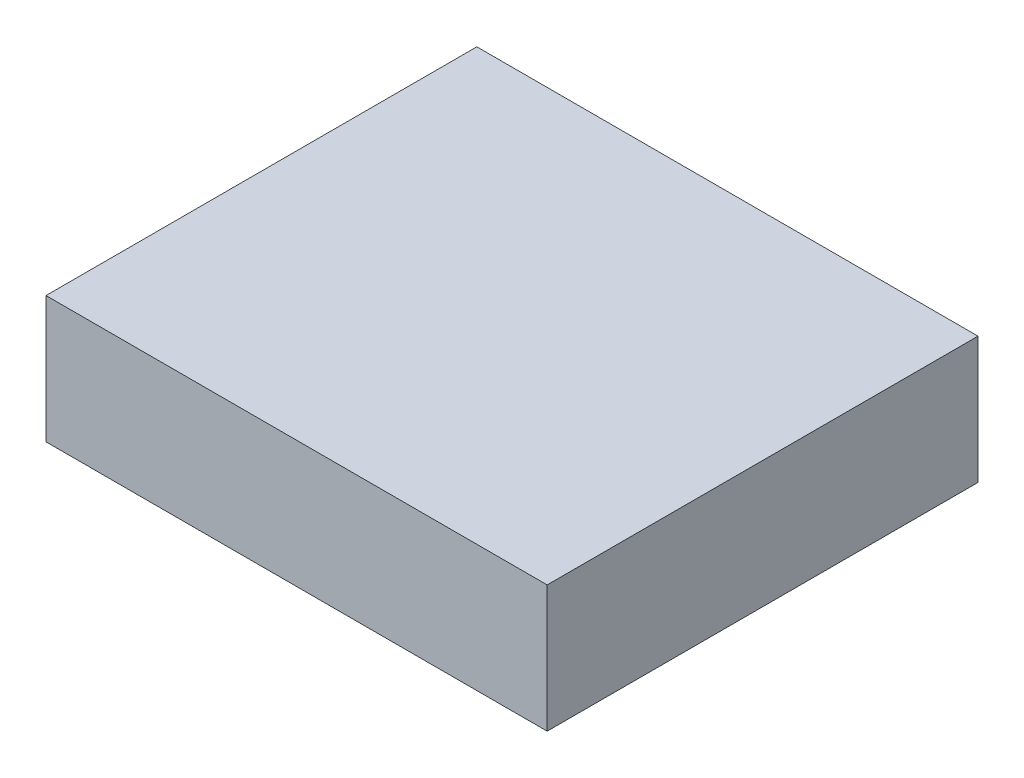
ISO-10303-21;
HEADER;
FILE_DESCRIPTION(('STEP AP214'),'2;1');
FILE_NAME('part.step','',(''),(''),'','','');
FILE_SCHEMA(('AUTOMOTIVE_DESIGN { 1 0 10303 214 1 1 1 1 }'));
ENDSEC;
DATA;
#1=APPLICATION_CONTEXT('core data for automotive mechanical design processes');
#2=APPLICATION_PROTOCOL_DEFINITION('international standard','automotive_design',2000,#1);
#3=PRODUCT_CONTEXT('',#1,'mechanical');
#4=PRODUCT('Part','Part','',(#3));
#5=PRODUCT_RELATED_PRODUCT_CATEGORY('part','',(#4));
#6=PRODUCT_DEFINITION_FORMATION('','',#4);
#7=PRODUCT_DEFINITION_CONTEXT('part definition',#1,'design');
#8=PRODUCT_DEFINITION('design','',#6,#7);
#9=PRODUCT_DEFINITION_SHAPE('','',#8);
#10=(LENGTH_UNIT() NAMED_UNIT(*) SI_UNIT(.MILLI.,.METRE.));
#11=(NAMED_UNIT(*) PLANE_ANGLE_UNIT() SI_UNIT($,.RADIAN.));
#12=(NAMED_UNIT(*) SI_UNIT($,.STERADIAN.) SOLID_ANGLE_UNIT());
#13=UNCERTAINTY_MEASURE_WITH_UNIT(LENGTH_MEASURE(1.E-05),#10,'distance_accuracy_value','');
#14=(GEOMETRIC_REPRESENTATION_CONTEXT(3) GLOBAL_UNCERTAINTY_ASSIGNED_CONTEXT((#13)) GLOBAL_UNIT_ASSIGNED_CONTEXT((#10,
#11,#12)) REPRESENTATION_CONTEXT('',''));
#15=CARTESIAN_POINT('',(0.,0.,0.));
#16=DIRECTION('',(0.,0.,1.));
#17=DIRECTION('',(1.,0.,0.));
#18=AXIS2_PLACEMENT_3D('',#15,#16,#17);
#19=CARTESIAN_POINT('',(0.,3.,0.));
#20=DIRECTION('',(0.,-1.,0.));
#21=DIRECTION('',(0.,0.,-1.));
#22=AXIS2_PLACEMENT_3D('',#19,#20,#21);
#23=PLANE('',#22);
#24=CARTESIAN_POINT('',(15.,3.,24.));
#25=DIRECTION('',(0.,1.,0.));
#26=DIRECTION('',(0.,0.,1.));
#27=AXIS2_PLACEMENT_3D('',#24,#25,#26);
#28=CIRCLE('',#27,10.5);
#29=CARTESIAN_POINT('',(15.,3.,34.5));
#30=VERTEX_POINT('',#29);
#31=EDGE_CURVE('E142',#30,#30,#28,.T.);
#32=ORIENTED_EDGE('',*,*,#31,.T.);
#33=EDGE_LOOP('',(#32));
#34=FACE_BOUND('',#33,.T.);
#35=DIRECTION('',(0.,0.,-1.));
#36=VECTOR('',#35,1.);
#37=CARTESIAN_POINT('',(-9.84277666215087,3.,40.));
#38=LINE('',#37,#36);
#39=CARTESIAN_POINT('',(-9.84277666215087,3.,39.8427766621509));
#40=VERTEX_POINT('',#39);
#41=CARTESIAN_POINT('',(-9.84277666215087,3.,48.8612539029861));
#42=VERTEX_POINT('',#41);
#43=EDGE_CURVE('E113',#40,#42,#38,.F.);
#44=ORIENTED_EDGE('',*,*,#43,.F.);
#45=DIRECTION('',(-1.,0.,0.));
#46=VECTOR('',#45,1.);
#47=CARTESIAN_POINT('',(-30.,3.,39.8427766621509));
#48=LINE('',#47,#46);
#49=CARTESIAN_POINT('',(-29.9475463643187,3.,39.8427766621509));
#50=VERTEX_POINT('',#49);
#51=EDGE_CURVE('E106',#50,#40,#48,.F.);
#52=ORIENTED_EDGE('',*,*,#51,.F.);
#53=CARTESIAN_POINT('',(0.,3.,0.));
#54=DIRECTION('',(0.,1.,0.));
#55=DIRECTION('',(0.,0.,1.));
#56=AXIS2_PLACEMENT_3D('',#53,#54,#55);
#57=CIRCLE('',#56,49.8427766621509);
#58=CARTESIAN_POINT('',(-42.8427766621509,3.,25.4715306424666));
#59=VERTEX_POINT('',#58);
#60=EDGE_CURVE('E110',#59,#50,#57,.T.);
#61=ORIENTED_EDGE('',*,*,#60,.F.);
#62=DIRECTION('',(0.,0.,-1.));
#63=VECTOR('',#62,1.);
#64=CARTESIAN_POINT('',(-42.8427766621509,3.,-25.5147016443462));
#65=LINE('',#64,#63);
#66=CARTESIAN_POINT('',(-42.8427766621509,3.,-25.4715306424666));
#67=VERTEX_POINT('',#66);
#68=EDGE_CURVE('E126',#67,#59,#65,.F.);
#69=ORIENTED_EDGE('',*,*,#68,.F.);
#70=CARTESIAN_POINT('',(0.,3.,0.));
#71=DIRECTION('',(0.,1.,0.));
#72=DIRECTION('',(0.,0.,1.));
#73=AXIS2_PLACEMENT_3D('',#70,#71,#72);
#74=CIRCLE('',#73,49.8427766621509);
#75=EDGE_CURVE('E211',#42,#67,#74,.T.);
#76=ORIENTED_EDGE('',*,*,#75,.F.);
#77=EDGE_LOOP('',(#44,#52,#61,#69,#76));
#78=FACE_BOUND('',#77,.T.);
#79=ADVANCED_FACE('F36',(#34,#78),#23,.T.);
#80=CARTESIAN_POINT('',(0.,3.,0.));
#81=DIRECTION('',(0.,1.,0.));
#82=DIRECTION('',(0.,0.,1.));
#83=AXIS2_PLACEMENT_3D('',#80,#81,#82);
#84=PLANE('',#83);
#85=CARTESIAN_POINT('',(15.,3.,24.));
#86=DIRECTION('',(0.,1.,0.));
#87=DIRECTION('',(0.,0.,1.));
#88=AXIS2_PLACEMENT_3D('',#85,#86,#87);
#89=CIRCLE('',#88,9.);
#90=CARTESIAN_POINT('',(15.,3.,33.));
#91=VERTEX_POINT('',#90);
#92=EDGE_CURVE('E145',#91,#91,#89,.T.);
#93=ORIENTED_EDGE('',*,*,#92,.F.);
#94=EDGE_LOOP('',(#93));
#95=FACE_BOUND('',#94,.T.);
#96=ADVANCED_FACE('F241',(#95),#84,.F.);
#97=CARTESIAN_POINT('',(15.,3.,24.));
#98=DIRECTION('',(0.,-1.,0.));
#99=DIRECTION('',(0.,0.,1.));
#100=AXIS2_PLACEMENT_3D('',#97,#98,#99);
#101=CONICAL_SURFACE('',#100,9.,0.05235987755983);
#102=CARTESIAN_POINT('',(15.,2.,24.));
#103=DIRECTION('',(0.,1.,0.));
#104=DIRECTION('',(0.,0.,1.));
#105=AXIS2_PLACEMENT_3D('',#102,#103,#104);
#106=CIRCLE('',#105,9.05240777928304);
#107=CARTESIAN_POINT('',(15.,2.,33.052407779283));
#108=VERTEX_POINT('',#107);
#109=EDGE_CURVE('E135',#108,#108,#106,.T.);
#110=ORIENTED_EDGE('',*,*,#109,.F.);
#111=EDGE_LOOP('',(#110));
#112=FACE_BOUND('',#111,.T.);
#113=ORIENTED_EDGE('',*,*,#92,.T.);
#114=EDGE_LOOP('',(#113));
#115=FACE_BOUND('',#114,.T.);
#116=ADVANCED_FACE('F247',(#112,#115),#101,.F.);
#117=CARTESIAN_POINT('',(15.,2.,24.));
#118=DIRECTION('',(0.,1.,0.));
#119=DIRECTION('',(0.,0.,1.));
#120=AXIS2_PLACEMENT_3D('',#117,#118,#119);
#121=PLANE('',#120);
#122=ORIENTED_EDGE('',*,*,#109,.T.);
#123=EDGE_LOOP('',(#122));
#124=FACE_BOUND('',#123,.T.);
#125=CARTESIAN_POINT('',(15.,2.,24.));
#126=DIRECTION('',(0.,1.,0.));
#127=DIRECTION('',(0.,0.,1.));
#128=AXIS2_PLACEMENT_3D('',#125,#126,#127);
#129=CIRCLE('',#128,10.447592220717);
#130=CARTESIAN_POINT('',(15.,2.,34.447592220717));
#131=VERTEX_POINT('',#130);
#132=EDGE_CURVE('E132',#131,#131,#129,.T.);
#133=ORIENTED_EDGE('',*,*,#132,.F.);
#134=EDGE_LOOP('',(#133));
#135=FACE_BOUND('',#134,.T.);
#136=ADVANCED_FACE('F256',(#124,#135),#121,.F.);
#137=CARTESIAN_POINT('',(15.,3.,24.));
#138=DIRECTION('',(0.,1.,0.));
#139=DIRECTION('',(0.,0.,1.));
#140=AXIS2_PLACEMENT_3D('',#137,#138,#139);
#141=CONICAL_SURFACE('',#140,10.5,0.05235987755983);
#142=ORIENTED_EDGE('',*,*,#132,.T.);
#143=EDGE_LOOP('',(#142));
#144=FACE_BOUND('',#143,.T.);
#145=ORIENTED_EDGE('',*,*,#31,.F.);
#146=EDGE_LOOP('',(#145));
#147=FACE_BOUND('',#146,.T.);
#148=ADVANCED_FACE('F259',(#144,#147),#141,.T.);
#149=CARTESIAN_POINT('',(0.,0.,0.));
#150=DIRECTION('',(0.,-1.,0.));
#151=DIRECTION('',(0.,0.,1.));
#152=AXIS2_PLACEMENT_3D('',#149,#150,#151);
#153=CONICAL_SURFACE('',#152,50.,0.05235987755983);
#154=CARTESIAN_POINT('',(0.,0.,0.));
#155=DIRECTION('',(0.,1.,0.));
#156=DIRECTION('',(0.,0.,1.));
#157=AXIS2_PLACEMENT_3D('',#154,#155,#156);
#158=CIRCLE('',#157,50.);
#159=CARTESIAN_POINT('',(-43.,0.,25.5147016443462));
#160=VERTEX_POINT('',#159);
#161=CARTESIAN_POINT('',(-30.,0.,40.));
#162=VERTEX_POINT('',#161);
#163=EDGE_CURVE('E178',#160,#162,#158,.T.);
#164=ORIENTED_EDGE('',*,*,#163,.F.);
#165=CARTESIAN_POINT('',(-42.8427766621509,3.,25.4715306424666));
#166=CARTESIAN_POINT('',(-42.8689805472113,2.50000008741177,25.4787319004716));
#167=CARTESIAN_POINT('',(-42.8951844345623,2.00000013111764,25.485930112964));
#168=CARTESIAN_POINT('',(-42.9475922138454,1.00000013111764,25.5003204469239));
#169=CARTESIAN_POINT('',(-42.9737961057774,0.500000087411772,25.5075125683913));
#170=CARTESIAN_POINT('',(-43.,0.,25.5147016443462));
#171=B_SPLINE_CURVE_WITH_KNOTS('',3,(#165,#166,#167,#168,#169,#170),.UNSPECIFIED.,.F.,.F.,(4,2,
4),(0.,1.50221360945296,3.00442721890574),.UNSPECIFIED.);
#172=EDGE_CURVE('E130',#59,#160,#171,.T.);
#173=ORIENTED_EDGE('',*,*,#172,.F.);
#174=ORIENTED_EDGE('',*,*,#60,.T.);
#175=CARTESIAN_POINT('',(-29.9475463643187,3.,39.8427766621509));
#176=CARTESIAN_POINT('',(-29.9562962840207,2.50000013333959,39.8689805448044));
#177=CARTESIAN_POINT('',(-29.9650423801785,2.00000020000936,39.8951844309519));
#178=CARTESIAN_POINT('',(-29.9825269254056,1.00000020000936,39.9475922102349));
#179=CARTESIAN_POINT('',(-29.9912653744749,0.500000133339591,39.9737961033704));
#180=CARTESIAN_POINT('',(-30.,0.,40.));
#181=B_SPLINE_CURVE_WITH_KNOTS('',3,(#175,#176,#177,#178,#179,#180),.UNSPECIFIED.,.F.,.F.,(4,2,
4),(0.,1.50228746936037,3.00457493872046),.UNSPECIFIED.);
#182=EDGE_CURVE('E121',#50,#162,#181,.T.);
#183=ORIENTED_EDGE('',*,*,#182,.T.);
#184=EDGE_LOOP('',(#164,#173,#174,#183));
#185=FACE_BOUND('',#184,.T.);
#186=ADVANCED_FACE('F128',(#185),#153,.F.);
#187=CARTESIAN_POINT('',(-43.,0.,-25.5147016443462));
#188=DIRECTION('',(-0.998629534754574,0.0523359562429439,0.));
#189=DIRECTION('',(-0.052335956242944,-0.998629534754574,0.));
#190=AXIS2_PLACEMENT_3D('',#187,#188,#189);
#191=PLANE('',#190);
#192=DIRECTION('',(0.,0.,1.));
#193=VECTOR('',#192,1.);
#194=CARTESIAN_POINT('',(-43.,0.,-25.5147016443462));
#195=LINE('',#194,#193);
#196=CARTESIAN_POINT('',(-43.,0.,-25.5147016443462));
#197=VERTEX_POINT('',#196);
#198=EDGE_CURVE('E181',#197,#160,#195,.T.);
#199=ORIENTED_EDGE('',*,*,#198,.F.);
#200=CARTESIAN_POINT('',(-42.8427766621509,3.,-25.4715306424666));
#201=CARTESIAN_POINT('',(-42.8689805472113,2.50000008741177,-25.4787319004716));
#202=CARTESIAN_POINT('',(-42.8951844345623,2.00000013111764,-25.485930112964));
#203=CARTESIAN_POINT('',(-42.9475922138454,1.00000013111764,-25.5003204469239));
#204=CARTESIAN_POINT('',(-42.9737961057774,0.500000087411773,-25.5075125683913));
#205=CARTESIAN_POINT('',(-43.,0.,-25.5147016443462));
#206=B_SPLINE_CURVE_WITH_KNOTS('',3,(#200,#201,#202,#203,#204,#205),.UNSPECIFIED.,.F.,.F.,(4,2,
4),(0.,1.50221360945296,3.00442721890574),.UNSPECIFIED.);
#207=EDGE_CURVE('E141',#67,#197,#206,.T.);
#208=ORIENTED_EDGE('',*,*,#207,.F.);
#209=ORIENTED_EDGE('',*,*,#68,.T.);
#210=ORIENTED_EDGE('',*,*,#172,.T.);
#211=EDGE_LOOP('',(#199,#208,#209,#210));
#212=FACE_BOUND('',#211,.T.);
#213=ADVANCED_FACE('F219',(#212),#191,.F.);
#214=CARTESIAN_POINT('',(0.,0.,0.));
#215=DIRECTION('',(0.,-1.,0.));
#216=DIRECTION('',(0.,0.,1.));
#217=AXIS2_PLACEMENT_3D('',#214,#215,#216);
#218=CONICAL_SURFACE('',#217,50.,0.05235987755983);
#219=CARTESIAN_POINT('',(0.,0.,0.));
#220=DIRECTION('',(0.,-1.,0.));
#221=DIRECTION('',(0.,0.,-1.));
#222=AXIS2_PLACEMENT_3D('',#219,#220,#221);
#223=CIRCLE('',#222,50.);
#224=CARTESIAN_POINT('',(-9.99999999999999,0.,48.9897948556636));
#225=VERTEX_POINT('',#224);
#226=EDGE_CURVE('E167',#225,#197,#223,.F.);
#227=ORIENTED_EDGE('',*,*,#226,.F.);
#228=CARTESIAN_POINT('',(-9.84277666215087,3.,48.8612539029861));
#229=CARTESIAN_POINT('',(-9.86898048888577,2.50000120032974,48.8827054863914));
#230=CARTESIAN_POINT('',(-9.895184347074,2.0000018004943,48.9041430241505));
#231=CARTESIAN_POINT('',(-9.94759212635704,1.0000018004943,48.9469900083763));
#232=CARTESIAN_POINT('',(-9.97379604745185,0.500001200329742,48.968399454843));
#233=CARTESIAN_POINT('',(-9.99999999999999,0.,48.9897948556636));
#234=B_SPLINE_CURVE_WITH_KNOTS('',3,(#228,#229,#230,#231,#232,#233),.UNSPECIFIED.,.F.,.F.,(4,2,
4),(0.,1.50343290186303,3.00686580372233),.UNSPECIFIED.);
#235=EDGE_CURVE('E117',#42,#225,#234,.T.);
#236=ORIENTED_EDGE('',*,*,#235,.F.);
#237=ORIENTED_EDGE('',*,*,#75,.T.);
#238=ORIENTED_EDGE('',*,*,#207,.T.);
#239=EDGE_LOOP('',(#227,#236,#237,#238));
#240=FACE_BOUND('',#239,.T.);
#241=ADVANCED_FACE('F222',(#240),#218,.F.);
#242=CARTESIAN_POINT('',(-9.99999999999999,0.,40.));
#243=DIRECTION('',(-0.998629534754574,0.0523359562429439,0.));
#244=DIRECTION('',(-0.052335956242944,-0.998629534754574,0.));
#245=AXIS2_PLACEMENT_3D('',#242,#243,#244);
#246=PLANE('',#245);
#247=DIRECTION('',(0.,0.,1.));
#248=VECTOR('',#247,1.);
#249=CARTESIAN_POINT('',(-9.99999999999999,0.,40.));
#250=LINE('',#249,#248);
#251=CARTESIAN_POINT('',(-10.,0.,40.));
#252=VERTEX_POINT('',#251);
#253=EDGE_CURVE('E177',#252,#225,#250,.T.);
#254=ORIENTED_EDGE('',*,*,#253,.F.);
#255=DIRECTION('',(-0.052264427688714,-0.997264688634237,0.0522644276887141));
#256=VECTOR('',#255,1.);
#257=CARTESIAN_POINT('',(-10.0546314080326,-1.04242936411264,40.0546314080326));
#258=LINE('',#257,#256);
#259=EDGE_CURVE('E116',#40,#252,#258,.T.);
#260=ORIENTED_EDGE('',*,*,#259,.F.);
#261=ORIENTED_EDGE('',*,*,#43,.T.);
#262=ORIENTED_EDGE('',*,*,#235,.T.);
#263=EDGE_LOOP('',(#254,#260,#261,#262));
#264=FACE_BOUND('',#263,.T.);
#265=ADVANCED_FACE('F227',(#264),#246,.F.);
#266=CARTESIAN_POINT('',(-30.,0.,40.));
#267=DIRECTION('',(0.,0.0523359562429439,0.998629534754574));
#268=DIRECTION('',(0.,-0.998629534754574,0.052335956242944));
#269=AXIS2_PLACEMENT_3D('',#266,#267,#268);
#270=PLANE('',#269);
#271=DIRECTION('',(1.,0.,0.));
#272=VECTOR('',#271,1.);
#273=CARTESIAN_POINT('',(-30.,0.,40.));
#274=LINE('',#273,#272);
#275=EDGE_CURVE('E123',#162,#252,#274,.T.);
#276=ORIENTED_EDGE('',*,*,#275,.F.);
#277=ORIENTED_EDGE('',*,*,#182,.F.);
#278=ORIENTED_EDGE('',*,*,#51,.T.);
#279=ORIENTED_EDGE('',*,*,#259,.T.);
#280=EDGE_LOOP('',(#276,#277,#278,#279));
#281=FACE_BOUND('',#280,.T.);
#282=ADVANCED_FACE('F122',(#281),#270,.F.);
#283=CARTESIAN_POINT('',(-43.,0.,-25.5147016443462));
#284=DIRECTION('',(0.,-1.,0.));
#285=DIRECTION('',(0.,0.,1.));
#286=AXIS2_PLACEMENT_3D('',#283,#284,#285);
#287=PLANE('',#286);
#288=DIRECTION('',(0.,0.,-1.));
#289=VECTOR('',#288,1.);
#290=CARTESIAN_POINT('',(79.1055408484251,0.,-68.0066108869367));
#291=LINE('',#290,#289);
#292=CARTESIAN_POINT('',(79.1055408484251,0.,68.0066108869367));
#293=VERTEX_POINT('',#292);
#294=CARTESIAN_POINT('',(79.1055408484251,0.,-68.0066108869367));
#295=VERTEX_POINT('',#294);
#296=EDGE_CURVE('E47',#293,#295,#291,.T.);
#297=ORIENTED_EDGE('',*,*,#296,.F.);
#298=DIRECTION('',(1.,0.,0.));
#299=VECTOR('',#298,1.);
#300=CARTESIAN_POINT('',(-79.1055408484251,0.,68.0066108869367));
#301=LINE('',#300,#299);
#302=CARTESIAN_POINT('',(-79.1055408484251,0.,68.0066108869367));
#303=VERTEX_POINT('',#302);
#304=EDGE_CURVE('E146',#303,#293,#301,.T.);
#305=ORIENTED_EDGE('',*,*,#304,.F.);
#306=DIRECTION('',(0.,0.,1.));
#307=VECTOR('',#306,1.);
#308=CARTESIAN_POINT('',(-79.1055408484251,0.,-68.0066108869367));
#309=LINE('',#308,#307);
#310=CARTESIAN_POINT('',(-79.1055408484251,0.,-68.0066108869367));
#311=VERTEX_POINT('',#310);
#312=EDGE_CURVE('E157',#311,#303,#309,.T.);
#313=ORIENTED_EDGE('',*,*,#312,.F.);
#314=DIRECTION('',(-1.,0.,0.));
#315=VECTOR('',#314,1.);
#316=CARTESIAN_POINT('',(-79.1055408484251,0.,-68.0066108869367));
#317=LINE('',#316,#315);
#318=EDGE_CURVE('E153',#295,#311,#317,.T.);
#319=ORIENTED_EDGE('',*,*,#318,.F.);
#320=EDGE_LOOP('',(#297,#305,#313,#319));
#321=FACE_BOUND('',#320,.T.);
#322=ORIENTED_EDGE('',*,*,#198,.T.);
#323=ORIENTED_EDGE('',*,*,#163,.T.);
#324=ORIENTED_EDGE('',*,*,#275,.T.);
#325=ORIENTED_EDGE('',*,*,#253,.T.);
#326=ORIENTED_EDGE('',*,*,#226,.T.);
#327=EDGE_LOOP('',(#322,#323,#324,#325,#326));
#328=FACE_BOUND('',#327,.T.);
#329=ADVANCED_FACE('F38',(#321,#328),#287,.T.);
#330=CARTESIAN_POINT('',(0.,40.,0.));
#331=DIRECTION('',(0.,1.,0.));
#332=DIRECTION('',(0.,0.,1.));
#333=AXIS2_PLACEMENT_3D('',#330,#331,#332);
#334=PLANE('',#333);
#335=DIRECTION('',(0.,0.,1.));
#336=VECTOR('',#335,1.);
#337=CARTESIAN_POINT('',(79.1055408484251,40.,-68.0066108869367));
#338=LINE('',#337,#336);
#339=CARTESIAN_POINT('',(79.1055408484251,40.,-68.0066108869367));
#340=VERTEX_POINT('',#339);
#341=CARTESIAN_POINT('',(79.1055408484251,40.,68.0066108869367));
#342=VERTEX_POINT('',#341);
#343=EDGE_CURVE('E11',#340,#342,#338,.T.);
#344=ORIENTED_EDGE('',*,*,#343,.F.);
#345=DIRECTION('',(1.,0.,0.));
#346=VECTOR('',#345,1.);
#347=CARTESIAN_POINT('',(-79.1055408484251,40.,-68.0066108869367));
#348=LINE('',#347,#346);
#349=CARTESIAN_POINT('',(-79.1055408484251,40.,-68.0066108869367));
#350=VERTEX_POINT('',#349);
#351=EDGE_CURVE('E156',#350,#340,#348,.T.);
#352=ORIENTED_EDGE('',*,*,#351,.F.);
#353=DIRECTION('',(0.,0.,-1.));
#354=VECTOR('',#353,1.);
#355=CARTESIAN_POINT('',(-79.1055408484251,40.,-68.0066108869367));
#356=LINE('',#355,#354);
#357=CARTESIAN_POINT('',(-79.1055408484251,40.,68.0066108869367));
#358=VERTEX_POINT('',#357);
#359=EDGE_CURVE('E160',#358,#350,#356,.T.);
#360=ORIENTED_EDGE('',*,*,#359,.F.);
#361=DIRECTION('',(-1.,0.,0.));
#362=VECTOR('',#361,1.);
#363=CARTESIAN_POINT('',(-79.1055408484251,40.,68.0066108869367));
#364=LINE('',#363,#362);
#365=EDGE_CURVE('E149',#342,#358,#364,.T.);
#366=ORIENTED_EDGE('',*,*,#365,.F.);
#367=EDGE_LOOP('',(#344,#352,#360,#366));
#368=FACE_BOUND('',#367,.T.);
#369=ADVANCED_FACE('F238',(#368),#334,.T.);
#370=CARTESIAN_POINT('',(-79.1055408484251,40.,68.0066108869367));
#371=DIRECTION('',(0.,0.,1.));
#372=DIRECTION('',(1.,0.,0.));
#373=AXIS2_PLACEMENT_3D('',#370,#371,#372);
#374=PLANE('',#373);
#375=DIRECTION('',(0.,-1.,0.));
#376=VECTOR('',#375,1.);
#377=CARTESIAN_POINT('',(-79.1055408484251,40.,68.0066108869367));
#378=LINE('',#377,#376);
#379=EDGE_CURVE('E150',#358,#303,#378,.T.);
#380=ORIENTED_EDGE('',*,*,#379,.T.);
#381=ORIENTED_EDGE('',*,*,#304,.T.);
#382=DIRECTION('',(0.,-1.,0.));
#383=VECTOR('',#382,1.);
#384=CARTESIAN_POINT('',(79.1055408484251,40.,68.0066108869367));
#385=LINE('',#384,#383);
#386=EDGE_CURVE('E152',#342,#293,#385,.T.);
#387=ORIENTED_EDGE('',*,*,#386,.F.);
#388=ORIENTED_EDGE('',*,*,#365,.T.);
#389=EDGE_LOOP('',(#380,#381,#387,#388));
#390=FACE_BOUND('',#389,.T.);
#391=ADVANCED_FACE('F251',(#390),#374,.T.);
#392=CARTESIAN_POINT('',(-79.1055408484251,40.,-68.0066108869367));
#393=DIRECTION('',(-1.,0.,0.));
#394=DIRECTION('',(0.,0.,1.));
#395=AXIS2_PLACEMENT_3D('',#392,#393,#394);
#396=PLANE('',#395);
#397=DIRECTION('',(0.,-1.,0.));
#398=VECTOR('',#397,1.);
#399=CARTESIAN_POINT('',(-79.1055408484251,40.,-68.0066108869367));
#400=LINE('',#399,#398);
#401=EDGE_CURVE('E161',#350,#311,#400,.T.);
#402=ORIENTED_EDGE('',*,*,#401,.T.);
#403=ORIENTED_EDGE('',*,*,#312,.T.);
#404=ORIENTED_EDGE('',*,*,#379,.F.);
#405=ORIENTED_EDGE('',*,*,#359,.T.);
#406=EDGE_LOOP('',(#402,#403,#404,#405));
#407=FACE_BOUND('',#406,.T.);
#408=ADVANCED_FACE('F341',(#407),#396,.T.);
#409=CARTESIAN_POINT('',(-79.1055408484251,40.,-68.0066108869367));
#410=DIRECTION('',(0.,0.,-1.));
#411=DIRECTION('',(-1.,0.,0.));
#412=AXIS2_PLACEMENT_3D('',#409,#410,#411);
#413=PLANE('',#412);
#414=DIRECTION('',(0.,-1.,0.));
#415=VECTOR('',#414,1.);
#416=CARTESIAN_POINT('',(79.1055408484251,40.,-68.0066108869367));
#417=LINE('',#416,#415);
#418=EDGE_CURVE('E55',#340,#295,#417,.T.);
#419=ORIENTED_EDGE('',*,*,#418,.T.);
#420=ORIENTED_EDGE('',*,*,#318,.T.);
#421=ORIENTED_EDGE('',*,*,#401,.F.);
#422=ORIENTED_EDGE('',*,*,#351,.T.);
#423=EDGE_LOOP('',(#419,#420,#421,#422));
#424=FACE_BOUND('',#423,.T.);
#425=ADVANCED_FACE('F350',(#424),#413,.T.);
#426=CARTESIAN_POINT('',(79.1055408484251,40.,-68.0066108869367));
#427=DIRECTION('',(1.,0.,0.));
#428=DIRECTION('',(0.,0.,-1.));
#429=AXIS2_PLACEMENT_3D('',#426,#427,#428);
#430=PLANE('',#429);
#431=ORIENTED_EDGE('',*,*,#386,.T.);
#432=ORIENTED_EDGE('',*,*,#296,.T.);
#433=ORIENTED_EDGE('',*,*,#418,.F.);
#434=ORIENTED_EDGE('',*,*,#343,.T.);
#435=EDGE_LOOP('',(#431,#432,#433,#434));
#436=FACE_BOUND('',#435,.T.);
#437=ADVANCED_FACE('F359',(#436),#430,.T.);
#438=CLOSED_SHELL('',(#79,#96,#116,#136,#148,#186,#213,#241,#265,#282,#329,#369,#391,#408,#425,#437));
#439=MANIFOLD_SOLID_BREP('B2',#438);
#440=ADVANCED_BREP_SHAPE_REPRESENTATION('',(#18,#439),#14);
#441=SHAPE_DEFINITION_REPRESENTATION(#9,#440);
ENDSEC;
END-ISO-10303-21;
